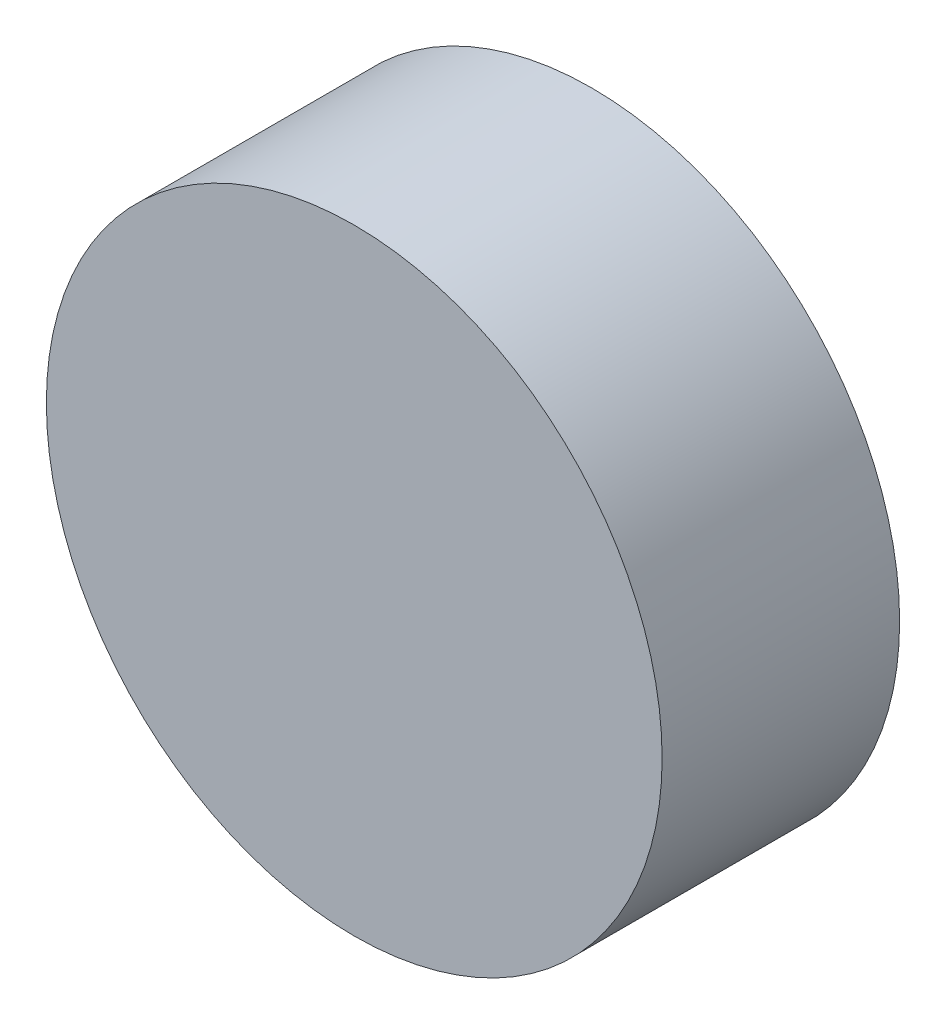
ISO-10303-21;
HEADER;
FILE_DESCRIPTION(('STEP AP214'),'2;1');
FILE_NAME('part.step','',(''),(''),'','','');
FILE_SCHEMA(('AUTOMOTIVE_DESIGN { 1 0 10303 214 1 1 1 1 }'));
ENDSEC;
DATA;
#1=APPLICATION_CONTEXT('core data for automotive mechanical design processes');
#2=APPLICATION_PROTOCOL_DEFINITION('international standard','automotive_design',2000,#1);
#3=PRODUCT_CONTEXT('',#1,'mechanical');
#4=PRODUCT('Part','Part','',(#3));
#5=PRODUCT_RELATED_PRODUCT_CATEGORY('part','',(#4));
#6=PRODUCT_DEFINITION_FORMATION('','',#4);
#7=PRODUCT_DEFINITION_CONTEXT('part definition',#1,'design');
#8=PRODUCT_DEFINITION('design','',#6,#7);
#9=PRODUCT_DEFINITION_SHAPE('','',#8);
#10=(LENGTH_UNIT() NAMED_UNIT(*) SI_UNIT(.MILLI.,.METRE.));
#11=(NAMED_UNIT(*) PLANE_ANGLE_UNIT() SI_UNIT($,.RADIAN.));
#12=(NAMED_UNIT(*) SI_UNIT($,.STERADIAN.) SOLID_ANGLE_UNIT());
#13=UNCERTAINTY_MEASURE_WITH_UNIT(LENGTH_MEASURE(1.E-05),#10,'distance_accuracy_value','');
#14=(GEOMETRIC_REPRESENTATION_CONTEXT(3) GLOBAL_UNCERTAINTY_ASSIGNED_CONTEXT((#13)) GLOBAL_UNIT_ASSIGNED_CONTEXT((#10,
#11,#12)) REPRESENTATION_CONTEXT('',''));
#15=CARTESIAN_POINT('',(0.,0.,0.));
#16=DIRECTION('',(0.,0.,1.));
#17=DIRECTION('',(1.,0.,0.));
#18=AXIS2_PLACEMENT_3D('',#15,#16,#17);
#19=CARTESIAN_POINT('',(0.,0.,13.5));
#20=DIRECTION('',(0.,0.,-1.));
#21=DIRECTION('',(-1.,0.,0.));
#22=AXIS2_PLACEMENT_3D('',#19,#20,#21);
#23=CYLINDRICAL_SURFACE('',#22,35.);
#24=CARTESIAN_POINT('',(0.,0.,13.5));
#25=DIRECTION('',(0.,0.,1.));
#26=DIRECTION('',(1.,0.,0.));
#27=AXIS2_PLACEMENT_3D('',#24,#25,#26);
#28=CIRCLE('',#27,35.);
#29=CARTESIAN_POINT('',(35.,0.,13.5));
#30=VERTEX_POINT('',#29);
#31=EDGE_CURVE('E10',#30,#30,#28,.T.);
#32=ORIENTED_EDGE('',*,*,#31,.F.);
#33=EDGE_LOOP('',(#32));
#34=FACE_BOUND('',#33,.T.);
#35=CARTESIAN_POINT('',(0.,0.,-13.5));
#36=DIRECTION('',(0.,0.,1.));
#37=DIRECTION('',(1.,0.,0.));
#38=AXIS2_PLACEMENT_3D('',#35,#36,#37);
#39=CIRCLE('',#38,35.);
#40=CARTESIAN_POINT('',(35.,0.,-13.5));
#41=VERTEX_POINT('',#40);
#42=EDGE_CURVE('E40',#41,#41,#39,.T.);
#43=ORIENTED_EDGE('',*,*,#42,.T.);
#44=EDGE_LOOP('',(#43));
#45=FACE_BOUND('',#44,.T.);
#46=ADVANCED_FACE('F37',(#34,#45),#23,.T.);
#47=CARTESIAN_POINT('',(0.,0.,13.5));
#48=DIRECTION('',(0.,0.,1.));
#49=DIRECTION('',(1.,0.,0.));
#50=AXIS2_PLACEMENT_3D('',#47,#48,#49);
#51=PLANE('',#50);
#52=ORIENTED_EDGE('',*,*,#31,.T.);
#53=EDGE_LOOP('',(#52));
#54=FACE_BOUND('',#53,.T.);
#55=ADVANCED_FACE('F54',(#54),#51,.T.);
#56=CARTESIAN_POINT('',(0.,0.,-13.5));
#57=DIRECTION('',(0.,0.,1.));
#58=DIRECTION('',(1.,0.,0.));
#59=AXIS2_PLACEMENT_3D('',#56,#57,#58);
#60=PLANE('',#59);
#61=ORIENTED_EDGE('',*,*,#42,.F.);
#62=EDGE_LOOP('',(#61));
#63=FACE_BOUND('',#62,.T.);
#64=ADVANCED_FACE('F52',(#63),#60,.F.);
#65=CLOSED_SHELL('',(#46,#55,#64));
#66=MANIFOLD_SOLID_BREP('B2',#65);
#67=ADVANCED_BREP_SHAPE_REPRESENTATION('',(#18,#66),#14);
#68=SHAPE_DEFINITION_REPRESENTATION(#9,#67);
ENDSEC;
END-ISO-10303-21;
